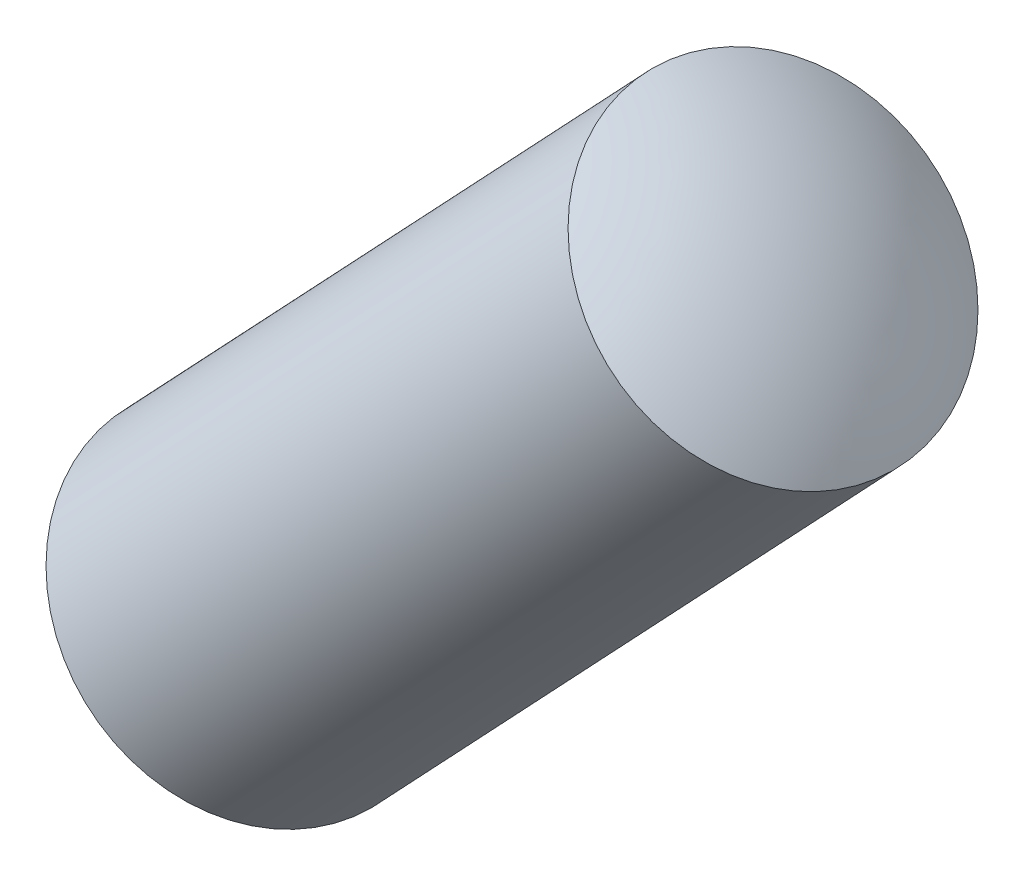
ISO-10303-21;
HEADER;
FILE_DESCRIPTION(('STEP AP214'),'2;1');
FILE_NAME('part.step','',(''),(''),'','','');
FILE_SCHEMA(('AUTOMOTIVE_DESIGN { 1 0 10303 214 1 1 1 1 }'));
ENDSEC;
DATA;
#1=APPLICATION_CONTEXT('core data for automotive mechanical design processes');
#2=APPLICATION_PROTOCOL_DEFINITION('international standard','automotive_design',2000,#1);
#3=PRODUCT_CONTEXT('',#1,'mechanical');
#4=PRODUCT('Part','Part','',(#3));
#5=PRODUCT_RELATED_PRODUCT_CATEGORY('part','',(#4));
#6=PRODUCT_DEFINITION_FORMATION('','',#4);
#7=PRODUCT_DEFINITION_CONTEXT('part definition',#1,'design');
#8=PRODUCT_DEFINITION('design','',#6,#7);
#9=PRODUCT_DEFINITION_SHAPE('','',#8);
#10=(LENGTH_UNIT() NAMED_UNIT(*) SI_UNIT(.MILLI.,.METRE.));
#11=(NAMED_UNIT(*) PLANE_ANGLE_UNIT() SI_UNIT($,.RADIAN.));
#12=(NAMED_UNIT(*) SI_UNIT($,.STERADIAN.) SOLID_ANGLE_UNIT());
#13=UNCERTAINTY_MEASURE_WITH_UNIT(LENGTH_MEASURE(1.E-05),#10,'distance_accuracy_value','');
#14=(GEOMETRIC_REPRESENTATION_CONTEXT(3) GLOBAL_UNCERTAINTY_ASSIGNED_CONTEXT((#13)) GLOBAL_UNIT_ASSIGNED_CONTEXT((#10,
#11,#12)) REPRESENTATION_CONTEXT('',''));
#15=CARTESIAN_POINT('',(0.,0.,0.));
#16=DIRECTION('',(0.,0.,1.));
#17=DIRECTION('',(1.,0.,0.));
#18=AXIS2_PLACEMENT_3D('',#15,#16,#17);
#19=CARTESIAN_POINT('',(-15.3099181059743,-16.2318855729201,0.599999999999989));
#20=DIRECTION('',(-0.727464820223147,0.686144981281437,0.));
#21=DIRECTION('',(-0.686144981281437,-0.727464820223147,0.));
#22=AXIS2_PLACEMENT_3D('',#19,#20,#21);
#23=SPHERICAL_SURFACE('',#22,2.);
#24=CARTESIAN_POINT('',(-15.3099181059743,-16.2318855729201,0.599999999999989));
#25=DIRECTION('',(0.686144981281438,0.727464820223147,0.));
#26=DIRECTION('',(0.,0.,-1.));
#27=AXIS2_PLACEMENT_3D('',#24,#25,#26);
#28=SPHERICAL_SURFACE('',#27,2.);
#29=CARTESIAN_POINT('',(-16.4983560749122,-17.4918916022655,0.6));
#30=DIRECTION('',(0.686144981281438,0.727464820223147,0.));
#31=DIRECTION('',(0.,0.,-1.));
#32=AXIS2_PLACEMENT_3D('',#29,#30,#31);
#33=CIRCLE('',#32,1.);
#34=CARTESIAN_POINT('',(-16.4983560749122,-17.4918916022655,-0.4));
#35=VERTEX_POINT('',#34);
#36=EDGE_CURVE('E11',#35,#35,#33,.T.);
#37=ORIENTED_EDGE('',*,*,#36,.F.);
#38=EDGE_LOOP('',(#37));
#39=FACE_BOUND('',#38,.T.);
#40=ADVANCED_FACE('F17',(#39),#28,.T.);
#41=CARTESIAN_POINT('',(-14.5373885797682,-15.4128341067869,0.6));
#42=DIRECTION('',(-0.727464820223147,0.686144981281437,0.));
#43=DIRECTION('',(0.686144981281437,0.727464820223147,0.));
#44=AXIS2_PLACEMENT_3D('',#41,#42,#43);
#45=SPHERICAL_SURFACE('',#44,2.);
#46=CARTESIAN_POINT('',(-14.5373885797682,-15.4128341067869,0.6));
#47=DIRECTION('',(0.686144981281438,0.727464820223147,0.));
#48=DIRECTION('',(0.,0.,-1.));
#49=AXIS2_PLACEMENT_3D('',#46,#47,#48);
#50=SPHERICAL_SURFACE('',#49,2.);
#51=CARTESIAN_POINT('',(-13.3489506108303,-14.1528280774413,0.599999999999989));
#52=DIRECTION('',(0.686144981281438,0.727464820223147,0.));
#53=DIRECTION('',(0.,0.,-1.));
#54=AXIS2_PLACEMENT_3D('',#51,#52,#53);
#55=CIRCLE('',#54,1.);
#56=CARTESIAN_POINT('',(-13.3489506108303,-14.1528280774413,-0.400000000000011));
#57=VERTEX_POINT('',#56);
#58=EDGE_CURVE('E25',#57,#57,#55,.T.);
#59=ORIENTED_EDGE('',*,*,#58,.T.);
#60=EDGE_LOOP('',(#59));
#61=FACE_BOUND('',#60,.T.);
#62=ADVANCED_FACE('F39',(#61),#50,.T.);
#63=CARTESIAN_POINT('',(-14.1363019768508,-14.9875939586473,0.599999999999989));
#64=DIRECTION('',(0.686144981281438,0.727464820223147,0.));
#65=DIRECTION('',(0.,0.,-1.));
#66=AXIS2_PLACEMENT_3D('',#63,#64,#65);
#67=CYLINDRICAL_SURFACE('',#66,1.);
#68=ORIENTED_EDGE('',*,*,#36,.T.);
#69=EDGE_LOOP('',(#68));
#70=FACE_BOUND('',#69,.T.);
#71=ORIENTED_EDGE('',*,*,#58,.F.);
#72=EDGE_LOOP('',(#71));
#73=FACE_BOUND('',#72,.T.);
#74=ADVANCED_FACE('F51',(#70,#73),#67,.T.);
#75=CLOSED_SHELL('',(#40,#62,#74));
#76=MANIFOLD_SOLID_BREP('B1',#75);
#77=ADVANCED_BREP_SHAPE_REPRESENTATION('',(#18,#76),#14);
#78=SHAPE_DEFINITION_REPRESENTATION(#9,#77);
ENDSEC;
END-ISO-10303-21;
